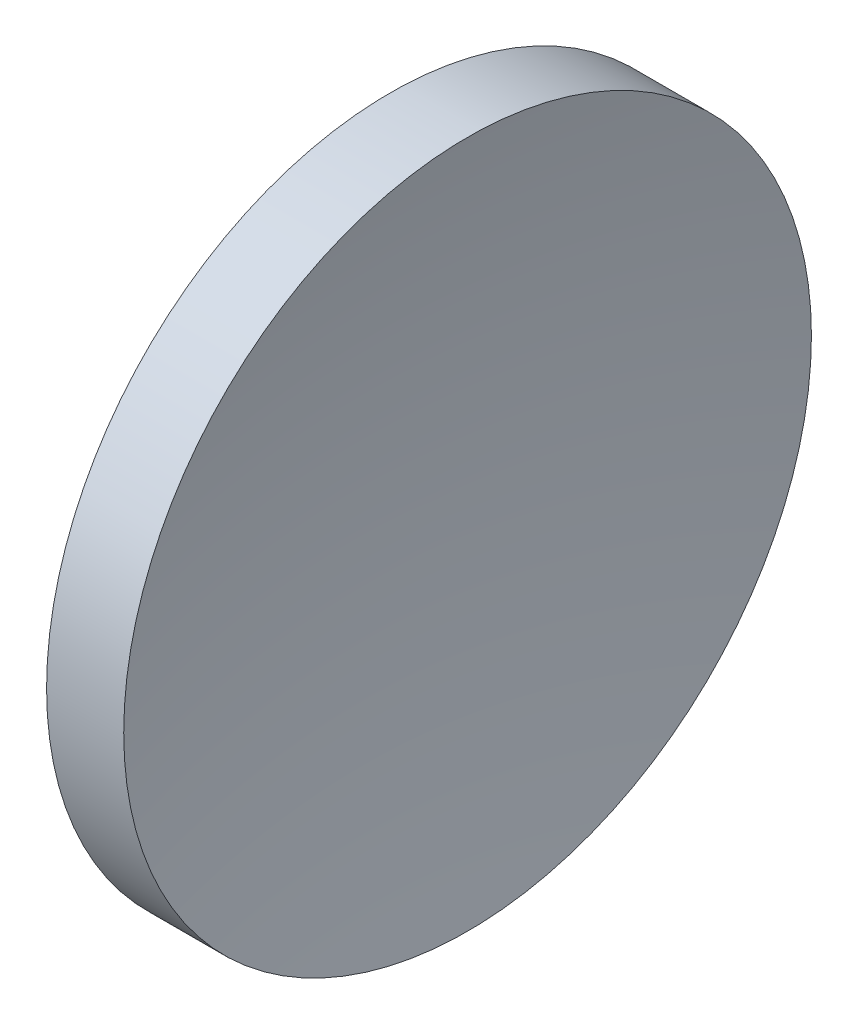
ISO-10303-21;
HEADER;
FILE_DESCRIPTION(('STEP AP214'),'2;1');
FILE_NAME('part.step','',(''),(''),'','','');
FILE_SCHEMA(('AUTOMOTIVE_DESIGN { 1 0 10303 214 1 1 1 1 }'));
ENDSEC;
DATA;
#1=APPLICATION_CONTEXT('core data for automotive mechanical design processes');
#2=APPLICATION_PROTOCOL_DEFINITION('international standard','automotive_design',2000,#1);
#3=PRODUCT_CONTEXT('',#1,'mechanical');
#4=PRODUCT('Part','Part','',(#3));
#5=PRODUCT_RELATED_PRODUCT_CATEGORY('part','',(#4));
#6=PRODUCT_DEFINITION_FORMATION('','',#4);
#7=PRODUCT_DEFINITION_CONTEXT('part definition',#1,'design');
#8=PRODUCT_DEFINITION('design','',#6,#7);
#9=PRODUCT_DEFINITION_SHAPE('','',#8);
#10=(LENGTH_UNIT() NAMED_UNIT(*) SI_UNIT(.MILLI.,.METRE.));
#11=(NAMED_UNIT(*) PLANE_ANGLE_UNIT() SI_UNIT($,.RADIAN.));
#12=(NAMED_UNIT(*) SI_UNIT($,.STERADIAN.) SOLID_ANGLE_UNIT());
#13=UNCERTAINTY_MEASURE_WITH_UNIT(LENGTH_MEASURE(1.E-05),#10,'distance_accuracy_value','');
#14=(GEOMETRIC_REPRESENTATION_CONTEXT(3) GLOBAL_UNCERTAINTY_ASSIGNED_CONTEXT((#13)) GLOBAL_UNIT_ASSIGNED_CONTEXT((#10,
#11,#12)) REPRESENTATION_CONTEXT('',''));
#15=CARTESIAN_POINT('',(0.,0.,0.));
#16=DIRECTION('',(0.,0.,1.));
#17=DIRECTION('',(1.,0.,0.));
#18=AXIS2_PLACEMENT_3D('',#15,#16,#17);
#19=CARTESIAN_POINT('',(219.69180719273,65.1556304570152,-0.160352326162863));
#20=DIRECTION('',(0.,-1.,0.));
#21=DIRECTION('',(0.,0.,1.));
#22=AXIS2_PLACEMENT_3D('',#19,#20,#21);
#23=CIRCLE('',#22,103.28);
#24=TRIMMED_CURVE('',#23,(PARAMETER_VALUE(-1.5692437281254)),(PARAMETER_VALUE(1.5692437281254)),
.T.,.PARAMETER.);
#25=CARTESIAN_POINT('',(219.69180719273,65.1556304570152,0.));
#26=DIRECTION('',(-1.,0.,0.));
#27=AXIS1_PLACEMENT('',#25,#26);
#28=SURFACE_OF_REVOLUTION('',#24,#27);
#29=CARTESIAN_POINT('',(118.398576451062,65.1556304570152,0.));
#30=DIRECTION('',(-1.,0.,0.));
#31=DIRECTION('',(0.,0.,1.));
#32=AXIS2_PLACEMENT_3D('',#29,#30,#31);
#33=CIRCLE('',#32,20.);
#34=CARTESIAN_POINT('',(118.398576451062,65.1556304570152,20.));
#35=VERTEX_POINT('',#34);
#36=EDGE_CURVE('E11',#35,#35,#33,.T.);
#37=ORIENTED_EDGE('',*,*,#36,.F.);
#38=EDGE_LOOP('',(#37));
#39=FACE_BOUND('',#38,.T.);
#40=CARTESIAN_POINT('',(116.41193167416,65.1556304570152,0.));
#41=VERTEX_POINT('',#40);
#42=VERTEX_LOOP('',#41);
#43=FACE_BOUND('',#42,.T.);
#44=ADVANCED_FACE('F37',(#39,#43),#28,.F.);
#45=CARTESIAN_POINT('',(105.62183712383,65.1556304570152,0.));
#46=DIRECTION('',(-1.,0.,0.));
#47=DIRECTION('',(0.,0.,1.));
#48=AXIS2_PLACEMENT_3D('',#45,#46,#47);
#49=CYLINDRICAL_SURFACE('',#48,20.);
#50=CARTESIAN_POINT('',(113.91193167416,65.1556304570152,0.));
#51=DIRECTION('',(-1.,0.,0.));
#52=DIRECTION('',(0.,0.,1.));
#53=AXIS2_PLACEMENT_3D('',#50,#51,#52);
#54=CIRCLE('',#53,20.);
#55=CARTESIAN_POINT('',(113.91193167416,65.1556304570152,20.));
#56=VERTEX_POINT('',#55);
#57=EDGE_CURVE('E43',#56,#56,#54,.T.);
#58=ORIENTED_EDGE('',*,*,#57,.F.);
#59=EDGE_LOOP('',(#58));
#60=FACE_BOUND('',#59,.T.);
#61=ORIENTED_EDGE('',*,*,#36,.T.);
#62=EDGE_LOOP('',(#61));
#63=FACE_BOUND('',#62,.T.);
#64=ADVANCED_FACE('F47',(#60,#63),#49,.T.);
#65=CARTESIAN_POINT('',(113.91193167416,65.1556304570152,0.));
#66=DIRECTION('',(1.,0.,0.));
#67=DIRECTION('',(0.,0.,-1.));
#68=AXIS2_PLACEMENT_3D('',#65,#66,#67);
#69=PLANE('',#68);
#70=ORIENTED_EDGE('',*,*,#57,.T.);
#71=EDGE_LOOP('',(#70));
#72=FACE_BOUND('',#71,.T.);
#73=ADVANCED_FACE('F52',(#72),#69,.F.);
#74=CLOSED_SHELL('',(#44,#64,#73));
#75=MANIFOLD_SOLID_BREP('B2',#74);
#76=ADVANCED_BREP_SHAPE_REPRESENTATION('',(#18,#75),#14);
#77=SHAPE_DEFINITION_REPRESENTATION(#9,#76);
ENDSEC;
END-ISO-10303-21;
